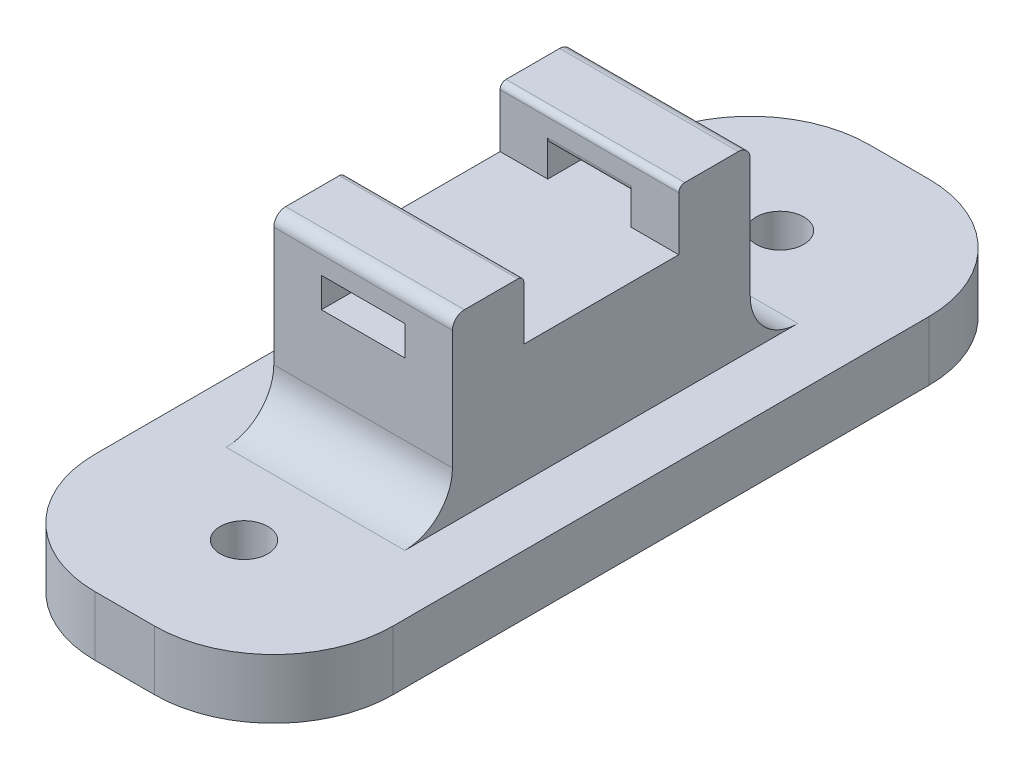
ISO-10303-21;
HEADER;
FILE_DESCRIPTION(('STEP AP214'),'2;1');
FILE_NAME('part.step','',(''),(''),'','','');
FILE_SCHEMA(('AUTOMOTIVE_DESIGN { 1 0 10303 214 1 1 1 1 }'));
ENDSEC;
DATA;
#1=APPLICATION_CONTEXT('core data for automotive mechanical design processes');
#2=APPLICATION_PROTOCOL_DEFINITION('international standard','automotive_design',2000,#1);
#3=PRODUCT_CONTEXT('',#1,'mechanical');
#4=PRODUCT('Part','Part','',(#3));
#5=PRODUCT_RELATED_PRODUCT_CATEGORY('part','',(#4));
#6=PRODUCT_DEFINITION_FORMATION('','',#4);
#7=PRODUCT_DEFINITION_CONTEXT('part definition',#1,'design');
#8=PRODUCT_DEFINITION('design','',#6,#7);
#9=PRODUCT_DEFINITION_SHAPE('','',#8);
#10=(LENGTH_UNIT() NAMED_UNIT(*) SI_UNIT(.MILLI.,.METRE.));
#11=(NAMED_UNIT(*) PLANE_ANGLE_UNIT() SI_UNIT($,.RADIAN.));
#12=(NAMED_UNIT(*) SI_UNIT($,.STERADIAN.) SOLID_ANGLE_UNIT());
#13=UNCERTAINTY_MEASURE_WITH_UNIT(LENGTH_MEASURE(1.E-05),#10,'distance_accuracy_value','');
#14=(GEOMETRIC_REPRESENTATION_CONTEXT(3) GLOBAL_UNCERTAINTY_ASSIGNED_CONTEXT((#13)) GLOBAL_UNIT_ASSIGNED_CONTEXT((#10,
#11,#12)) REPRESENTATION_CONTEXT('',''));
#15=CARTESIAN_POINT('',(0.,0.,0.));
#16=DIRECTION('',(0.,0.,1.));
#17=DIRECTION('',(1.,0.,0.));
#18=AXIS2_PLACEMENT_3D('',#15,#16,#17);
#19=CARTESIAN_POINT('',(0.,15.,0.));
#20=DIRECTION('',(0.,1.,0.));
#21=DIRECTION('',(0.,0.,1.));
#22=AXIS2_PLACEMENT_3D('',#19,#20,#21);
#23=PLANE('',#22);
#24=DIRECTION('',(-1.,0.,0.));
#25=VECTOR('',#24,1.);
#26=CARTESIAN_POINT('',(20.,15.,-26.));
#27=LINE('',#26,#25);
#28=CARTESIAN_POINT('',(9.,15.,-26.));
#29=VERTEX_POINT('',#28);
#30=CARTESIAN_POINT('',(5.,15.,-26.));
#31=VERTEX_POINT('',#30);
#32=EDGE_CURVE('E297',#29,#31,#27,.T.);
#33=ORIENTED_EDGE('',*,*,#32,.F.);
#34=DIRECTION('',(0.,0.,-1.));
#35=VECTOR('',#34,1.);
#36=CARTESIAN_POINT('',(9.,15.,0.));
#37=LINE('',#36,#35);
#38=CARTESIAN_POINT('',(9.,15.,-20.));
#39=VERTEX_POINT('',#38);
#40=EDGE_CURVE('E253',#39,#29,#37,.T.);
#41=ORIENTED_EDGE('',*,*,#40,.F.);
#42=DIRECTION('',(-1.,0.,0.));
#43=VECTOR('',#42,1.);
#44=CARTESIAN_POINT('',(20.,15.,-20.));
#45=LINE('',#44,#43);
#46=CARTESIAN_POINT('',(16.,15.,-20.));
#47=VERTEX_POINT('',#46);
#48=EDGE_CURVE('E281',#47,#39,#45,.T.);
#49=ORIENTED_EDGE('',*,*,#48,.F.);
#50=DIRECTION('',(0.,0.,-1.));
#51=VECTOR('',#50,1.);
#52=CARTESIAN_POINT('',(16.,15.,0.));
#53=LINE('',#52,#51);
#54=CARTESIAN_POINT('',(16.,15.,-26.));
#55=VERTEX_POINT('',#54);
#56=EDGE_CURVE('E254',#47,#55,#53,.T.);
#57=ORIENTED_EDGE('',*,*,#56,.T.);
#58=CARTESIAN_POINT('',(20.,15.,-26.));
#59=VERTEX_POINT('',#58);
#60=EDGE_CURVE('E301',#59,#55,#27,.T.);
#61=ORIENTED_EDGE('',*,*,#60,.F.);
#62=DIRECTION('',(0.,0.,-1.));
#63=VECTOR('',#62,1.);
#64=CARTESIAN_POINT('',(20.,15.,-20.));
#65=LINE('',#64,#63);
#66=CARTESIAN_POINT('',(20.,15.,-39.));
#67=VERTEX_POINT('',#66);
#68=EDGE_CURVE('E323',#59,#67,#65,.T.);
#69=ORIENTED_EDGE('',*,*,#68,.T.);
#70=DIRECTION('',(1.,0.,0.));
#71=VECTOR('',#70,1.);
#72=CARTESIAN_POINT('',(5.,15.,-39.));
#73=LINE('',#72,#71);
#74=CARTESIAN_POINT('',(16.,15.,-39.));
#75=VERTEX_POINT('',#74);
#76=EDGE_CURVE('E310',#75,#67,#73,.T.);
#77=ORIENTED_EDGE('',*,*,#76,.F.);
#78=CARTESIAN_POINT('',(16.,15.,-45.));
#79=VERTEX_POINT('',#78);
#80=EDGE_CURVE('E261',#75,#79,#53,.T.);
#81=ORIENTED_EDGE('',*,*,#80,.T.);
#82=DIRECTION('',(-1.,0.,0.));
#83=VECTOR('',#82,1.);
#84=CARTESIAN_POINT('',(16.,15.,-45.));
#85=LINE('',#84,#83);
#86=CARTESIAN_POINT('',(9.,15.,-45.));
#87=VERTEX_POINT('',#86);
#88=EDGE_CURVE('E258',#79,#87,#85,.T.);
#89=ORIENTED_EDGE('',*,*,#88,.T.);
#90=CARTESIAN_POINT('',(9.,15.,-39.));
#91=VERTEX_POINT('',#90);
#92=EDGE_CURVE('E241',#91,#87,#37,.T.);
#93=ORIENTED_EDGE('',*,*,#92,.F.);
#94=CARTESIAN_POINT('',(5.,15.,-39.));
#95=VERTEX_POINT('',#94);
#96=EDGE_CURVE('E314',#95,#91,#73,.T.);
#97=ORIENTED_EDGE('',*,*,#96,.F.);
#98=DIRECTION('',(0.,0.,1.));
#99=VECTOR('',#98,1.);
#100=CARTESIAN_POINT('',(5.,15.,-20.));
#101=LINE('',#100,#99);
#102=EDGE_CURVE('E326',#95,#31,#101,.T.);
#103=ORIENTED_EDGE('',*,*,#102,.T.);
#104=EDGE_LOOP('',(#33,#41,#49,#57,#61,#69,#77,#81,#89,#93,#97,#103));
#105=FACE_BOUND('',#104,.T.);
#106=ADVANCED_FACE('F32',(#105),#23,.T.);
#107=CARTESIAN_POINT('',(0.,5.,0.));
#108=DIRECTION('',(0.,-1.,0.));
#109=DIRECTION('',(0.,0.,-1.));
#110=AXIS2_PLACEMENT_3D('',#107,#108,#109);
#111=PLANE('',#110);
#112=DIRECTION('',(1.,0.,0.));
#113=VECTOR('',#112,1.);
#114=CARTESIAN_POINT('',(0.,5.,0.));
#115=LINE('',#114,#113);
#116=CARTESIAN_POINT('',(10.,5.,0.));
#117=VERTEX_POINT('',#116);
#118=CARTESIAN_POINT('',(15.,5.,0.));
#119=VERTEX_POINT('',#118);
#120=EDGE_CURVE('E359',#117,#119,#115,.T.);
#121=ORIENTED_EDGE('',*,*,#120,.T.);
#122=CARTESIAN_POINT('',(15.,5.,-10.));
#123=DIRECTION('',(0.,-1.,0.));
#124=DIRECTION('',(0.,0.,-1.));
#125=AXIS2_PLACEMENT_3D('',#122,#123,#124);
#126=CIRCLE('',#125,10.);
#127=CARTESIAN_POINT('',(25.,5.,-10.));
#128=VERTEX_POINT('',#127);
#129=EDGE_CURVE('E465',#119,#128,#126,.F.);
#130=ORIENTED_EDGE('',*,*,#129,.T.);
#131=DIRECTION('',(0.,0.,-1.));
#132=VECTOR('',#131,1.);
#133=CARTESIAN_POINT('',(25.,5.,0.));
#134=LINE('',#133,#132);
#135=CARTESIAN_POINT('',(25.,5.,-55.));
#136=VERTEX_POINT('',#135);
#137=EDGE_CURVE('E363',#128,#136,#134,.T.);
#138=ORIENTED_EDGE('',*,*,#137,.T.);
#139=CARTESIAN_POINT('',(15.,5.,-55.));
#140=DIRECTION('',(0.,-1.,0.));
#141=DIRECTION('',(0.,0.,-1.));
#142=AXIS2_PLACEMENT_3D('',#139,#140,#141);
#143=CIRCLE('',#142,10.);
#144=CARTESIAN_POINT('',(15.,5.,-65.));
#145=VERTEX_POINT('',#144);
#146=EDGE_CURVE('E459',#136,#145,#143,.F.);
#147=ORIENTED_EDGE('',*,*,#146,.T.);
#148=DIRECTION('',(-1.,0.,0.));
#149=VECTOR('',#148,1.);
#150=CARTESIAN_POINT('',(0.,5.,-65.));
#151=LINE('',#150,#149);
#152=CARTESIAN_POINT('',(10.,5.,-65.));
#153=VERTEX_POINT('',#152);
#154=EDGE_CURVE('E366',#145,#153,#151,.T.);
#155=ORIENTED_EDGE('',*,*,#154,.T.);
#156=CARTESIAN_POINT('',(10.,5.,-55.));
#157=DIRECTION('',(0.,-1.,0.));
#158=DIRECTION('',(0.,0.,-1.));
#159=AXIS2_PLACEMENT_3D('',#156,#157,#158);
#160=CIRCLE('',#159,10.);
#161=CARTESIAN_POINT('',(0.,5.,-55.));
#162=VERTEX_POINT('',#161);
#163=EDGE_CURVE('E461',#153,#162,#160,.F.);
#164=ORIENTED_EDGE('',*,*,#163,.T.);
#165=DIRECTION('',(0.,0.,1.));
#166=VECTOR('',#165,1.);
#167=CARTESIAN_POINT('',(0.,5.,0.));
#168=LINE('',#167,#166);
#169=CARTESIAN_POINT('',(0.,5.,-10.));
#170=VERTEX_POINT('',#169);
#171=EDGE_CURVE('E356',#162,#170,#168,.T.);
#172=ORIENTED_EDGE('',*,*,#171,.T.);
#173=CARTESIAN_POINT('',(10.,5.,-10.));
#174=DIRECTION('',(0.,-1.,0.));
#175=DIRECTION('',(0.,0.,-1.));
#176=AXIS2_PLACEMENT_3D('',#173,#174,#175);
#177=CIRCLE('',#176,10.);
#178=EDGE_CURVE('E463',#170,#117,#177,.F.);
#179=ORIENTED_EDGE('',*,*,#178,.T.);
#180=EDGE_LOOP('',(#121,#130,#138,#147,#155,#164,#172,#179));
#181=FACE_BOUND('',#180,.T.);
#182=CARTESIAN_POINT('',(12.5,5.,-10.));
#183=DIRECTION('',(0.,1.,0.));
#184=DIRECTION('',(0.,0.,1.));
#185=AXIS2_PLACEMENT_3D('',#182,#183,#184);
#186=CIRCLE('',#185,2.);
#187=CARTESIAN_POINT('',(12.5,5.,-8.));
#188=VERTEX_POINT('',#187);
#189=EDGE_CURVE('E351',#188,#188,#186,.T.);
#190=ORIENTED_EDGE('',*,*,#189,.F.);
#191=EDGE_LOOP('',(#190));
#192=FACE_BOUND('',#191,.T.);
#193=CARTESIAN_POINT('',(12.5,5.,-55.));
#194=DIRECTION('',(0.,1.,0.));
#195=DIRECTION('',(0.,0.,1.));
#196=AXIS2_PLACEMENT_3D('',#193,#194,#195);
#197=CIRCLE('',#196,2.);
#198=CARTESIAN_POINT('',(12.5,5.,-53.));
#199=VERTEX_POINT('',#198);
#200=EDGE_CURVE('E344',#199,#199,#197,.T.);
#201=ORIENTED_EDGE('',*,*,#200,.F.);
#202=EDGE_LOOP('',(#201));
#203=FACE_BOUND('',#202,.T.);
#204=DIRECTION('',(0.,0.,1.));
#205=VECTOR('',#204,1.);
#206=CARTESIAN_POINT('',(5.,5.,-20.));
#207=LINE('',#206,#205);
#208=CARTESIAN_POINT('',(5.,5.,-49.));
#209=VERTEX_POINT('',#208);
#210=CARTESIAN_POINT('',(5.,5.,-16.));
#211=VERTEX_POINT('',#210);
#212=EDGE_CURVE('E327',#209,#211,#207,.T.);
#213=ORIENTED_EDGE('',*,*,#212,.F.);
#214=DIRECTION('',(-1.,0.,0.));
#215=VECTOR('',#214,1.);
#216=CARTESIAN_POINT('',(20.,5.,-49.));
#217=LINE('',#216,#215);
#218=CARTESIAN_POINT('',(20.,5.,-49.));
#219=VERTEX_POINT('',#218);
#220=EDGE_CURVE('E483',#209,#219,#217,.F.);
#221=ORIENTED_EDGE('',*,*,#220,.T.);
#222=DIRECTION('',(0.,0.,-1.));
#223=VECTOR('',#222,1.);
#224=CARTESIAN_POINT('',(20.,5.,-20.));
#225=LINE('',#224,#223);
#226=CARTESIAN_POINT('',(20.,5.,-16.));
#227=VERTEX_POINT('',#226);
#228=EDGE_CURVE('E322',#227,#219,#225,.T.);
#229=ORIENTED_EDGE('',*,*,#228,.F.);
#230=DIRECTION('',(1.,0.,0.));
#231=VECTOR('',#230,1.);
#232=CARTESIAN_POINT('',(5.,5.,-16.));
#233=LINE('',#232,#231);
#234=EDGE_CURVE('E480',#227,#211,#233,.F.);
#235=ORIENTED_EDGE('',*,*,#234,.T.);
#236=EDGE_LOOP('',(#213,#221,#229,#235));
#237=FACE_BOUND('',#236,.T.);
#238=ADVANCED_FACE('F497',(#181,#192,#203,#237),#111,.F.);
#239=CARTESIAN_POINT('',(0.,5.,0.));
#240=DIRECTION('',(1.,0.,0.));
#241=DIRECTION('',(0.,0.,-1.));
#242=AXIS2_PLACEMENT_3D('',#239,#240,#241);
#243=PLANE('',#242);
#244=DIRECTION('',(0.,0.,1.));
#245=VECTOR('',#244,1.);
#246=CARTESIAN_POINT('',(0.,0.,0.));
#247=LINE('',#246,#245);
#248=CARTESIAN_POINT('',(0.,0.,-55.));
#249=VERTEX_POINT('',#248);
#250=CARTESIAN_POINT('',(0.,0.,-10.));
#251=VERTEX_POINT('',#250);
#252=EDGE_CURVE('E347',#249,#251,#247,.T.);
#253=ORIENTED_EDGE('',*,*,#252,.T.);
#254=DIRECTION('',(0.,-1.,0.));
#255=VECTOR('',#254,1.);
#256=CARTESIAN_POINT('',(0.,5.,-10.));
#257=LINE('',#256,#255);
#258=EDGE_CURVE('E470',#251,#170,#257,.F.);
#259=ORIENTED_EDGE('',*,*,#258,.T.);
#260=ORIENTED_EDGE('',*,*,#171,.F.);
#261=DIRECTION('',(0.,-1.,0.));
#262=VECTOR('',#261,1.);
#263=CARTESIAN_POINT('',(0.,5.,-55.));
#264=LINE('',#263,#262);
#265=EDGE_CURVE('E467',#162,#249,#264,.T.);
#266=ORIENTED_EDGE('',*,*,#265,.T.);
#267=EDGE_LOOP('',(#253,#259,#260,#266));
#268=FACE_BOUND('',#267,.T.);
#269=ADVANCED_FACE('F559',(#268),#243,.F.);
#270=CARTESIAN_POINT('',(0.,5.,0.));
#271=DIRECTION('',(0.,0.,-1.));
#272=DIRECTION('',(-1.,0.,0.));
#273=AXIS2_PLACEMENT_3D('',#270,#271,#272);
#274=PLANE('',#273);
#275=DIRECTION('',(1.,0.,0.));
#276=VECTOR('',#275,1.);
#277=CARTESIAN_POINT('',(0.,0.,0.));
#278=LINE('',#277,#276);
#279=CARTESIAN_POINT('',(10.,0.,0.));
#280=VERTEX_POINT('',#279);
#281=CARTESIAN_POINT('',(15.,0.,0.));
#282=VERTEX_POINT('',#281);
#283=EDGE_CURVE('E372',#280,#282,#278,.T.);
#284=ORIENTED_EDGE('',*,*,#283,.T.);
#285=DIRECTION('',(0.,-1.,0.));
#286=VECTOR('',#285,1.);
#287=CARTESIAN_POINT('',(15.,5.,0.));
#288=LINE('',#287,#286);
#289=EDGE_CURVE('E457',#282,#119,#288,.F.);
#290=ORIENTED_EDGE('',*,*,#289,.T.);
#291=ORIENTED_EDGE('',*,*,#120,.F.);
#292=DIRECTION('',(0.,-1.,0.));
#293=VECTOR('',#292,1.);
#294=CARTESIAN_POINT('',(10.,5.,0.));
#295=LINE('',#294,#293);
#296=EDGE_CURVE('E454',#117,#280,#295,.T.);
#297=ORIENTED_EDGE('',*,*,#296,.T.);
#298=EDGE_LOOP('',(#284,#290,#291,#297));
#299=FACE_BOUND('',#298,.T.);
#300=ADVANCED_FACE('F751',(#299),#274,.F.);
#301=CARTESIAN_POINT('',(25.,5.,0.));
#302=DIRECTION('',(-1.,0.,0.));
#303=DIRECTION('',(0.,0.,1.));
#304=AXIS2_PLACEMENT_3D('',#301,#302,#303);
#305=PLANE('',#304);
#306=ORIENTED_EDGE('',*,*,#137,.F.);
#307=DIRECTION('',(0.,-1.,0.));
#308=VECTOR('',#307,1.);
#309=CARTESIAN_POINT('',(25.,5.,-10.));
#310=LINE('',#309,#308);
#311=CARTESIAN_POINT('',(25.,0.,-10.));
#312=VERTEX_POINT('',#311);
#313=EDGE_CURVE('E443',#128,#312,#310,.T.);
#314=ORIENTED_EDGE('',*,*,#313,.T.);
#315=DIRECTION('',(0.,0.,-1.));
#316=VECTOR('',#315,1.);
#317=CARTESIAN_POINT('',(25.,0.,0.));
#318=LINE('',#317,#316);
#319=CARTESIAN_POINT('',(25.,0.,-55.));
#320=VERTEX_POINT('',#319);
#321=EDGE_CURVE('E375',#312,#320,#318,.T.);
#322=ORIENTED_EDGE('',*,*,#321,.T.);
#323=DIRECTION('',(0.,-1.,0.));
#324=VECTOR('',#323,1.);
#325=CARTESIAN_POINT('',(25.,5.,-55.));
#326=LINE('',#325,#324);
#327=EDGE_CURVE('E441',#320,#136,#326,.F.);
#328=ORIENTED_EDGE('',*,*,#327,.T.);
#329=EDGE_LOOP('',(#306,#314,#322,#328));
#330=FACE_BOUND('',#329,.T.);
#331=ADVANCED_FACE('F741',(#330),#305,.F.);
#332=CARTESIAN_POINT('',(0.,5.,-65.));
#333=DIRECTION('',(0.,0.,1.));
#334=DIRECTION('',(1.,0.,0.));
#335=AXIS2_PLACEMENT_3D('',#332,#333,#334);
#336=PLANE('',#335);
#337=DIRECTION('',(-1.,0.,0.));
#338=VECTOR('',#337,1.);
#339=CARTESIAN_POINT('',(0.,0.,-65.));
#340=LINE('',#339,#338);
#341=CARTESIAN_POINT('',(15.,0.,-65.));
#342=VERTEX_POINT('',#341);
#343=CARTESIAN_POINT('',(10.,0.,-65.));
#344=VERTEX_POINT('',#343);
#345=EDGE_CURVE('E360',#342,#344,#340,.T.);
#346=ORIENTED_EDGE('',*,*,#345,.T.);
#347=DIRECTION('',(0.,-1.,0.));
#348=VECTOR('',#347,1.);
#349=CARTESIAN_POINT('',(10.,5.,-65.));
#350=LINE('',#349,#348);
#351=EDGE_CURVE('E475',#344,#153,#350,.F.);
#352=ORIENTED_EDGE('',*,*,#351,.T.);
#353=ORIENTED_EDGE('',*,*,#154,.F.);
#354=DIRECTION('',(0.,-1.,0.));
#355=VECTOR('',#354,1.);
#356=CARTESIAN_POINT('',(15.,5.,-65.));
#357=LINE('',#356,#355);
#358=EDGE_CURVE('E472',#145,#342,#357,.T.);
#359=ORIENTED_EDGE('',*,*,#358,.T.);
#360=EDGE_LOOP('',(#346,#352,#353,#359));
#361=FACE_BOUND('',#360,.T.);
#362=ADVANCED_FACE('F729',(#361),#336,.F.);
#363=CARTESIAN_POINT('',(0.,0.,0.));
#364=DIRECTION('',(0.,-1.,0.));
#365=DIRECTION('',(0.,0.,-1.));
#366=AXIS2_PLACEMENT_3D('',#363,#364,#365);
#367=PLANE('',#366);
#368=CARTESIAN_POINT('',(12.5,0.,-55.));
#369=DIRECTION('',(0.,1.,0.));
#370=DIRECTION('',(0.,0.,1.));
#371=AXIS2_PLACEMENT_3D('',#368,#369,#370);
#372=CIRCLE('',#371,2.);
#373=CARTESIAN_POINT('',(12.5,0.,-53.));
#374=VERTEX_POINT('',#373);
#375=EDGE_CURVE('E348',#374,#374,#372,.T.);
#376=ORIENTED_EDGE('',*,*,#375,.T.);
#377=EDGE_LOOP('',(#376));
#378=FACE_BOUND('',#377,.T.);
#379=CARTESIAN_POINT('',(12.5,0.,-10.));
#380=DIRECTION('',(0.,1.,0.));
#381=DIRECTION('',(0.,0.,1.));
#382=AXIS2_PLACEMENT_3D('',#379,#380,#381);
#383=CIRCLE('',#382,2.);
#384=CARTESIAN_POINT('',(12.5,0.,-8.));
#385=VERTEX_POINT('',#384);
#386=EDGE_CURVE('E343',#385,#385,#383,.T.);
#387=ORIENTED_EDGE('',*,*,#386,.T.);
#388=EDGE_LOOP('',(#387));
#389=FACE_BOUND('',#388,.T.);
#390=ORIENTED_EDGE('',*,*,#321,.F.);
#391=CARTESIAN_POINT('',(15.,0.,-10.));
#392=DIRECTION('',(0.,-1.,0.));
#393=DIRECTION('',(0.,0.,-1.));
#394=AXIS2_PLACEMENT_3D('',#391,#392,#393);
#395=CIRCLE('',#394,10.);
#396=EDGE_CURVE('E452',#312,#282,#395,.T.);
#397=ORIENTED_EDGE('',*,*,#396,.T.);
#398=ORIENTED_EDGE('',*,*,#283,.F.);
#399=CARTESIAN_POINT('',(10.,0.,-10.));
#400=DIRECTION('',(0.,-1.,0.));
#401=DIRECTION('',(0.,0.,-1.));
#402=AXIS2_PLACEMENT_3D('',#399,#400,#401);
#403=CIRCLE('',#402,10.);
#404=EDGE_CURVE('E450',#280,#251,#403,.T.);
#405=ORIENTED_EDGE('',*,*,#404,.T.);
#406=ORIENTED_EDGE('',*,*,#252,.F.);
#407=CARTESIAN_POINT('',(10.,0.,-55.));
#408=DIRECTION('',(0.,-1.,0.));
#409=DIRECTION('',(0.,0.,-1.));
#410=AXIS2_PLACEMENT_3D('',#407,#408,#409);
#411=CIRCLE('',#410,10.);
#412=EDGE_CURVE('E448',#249,#344,#411,.T.);
#413=ORIENTED_EDGE('',*,*,#412,.T.);
#414=ORIENTED_EDGE('',*,*,#345,.F.);
#415=CARTESIAN_POINT('',(15.,0.,-55.));
#416=DIRECTION('',(0.,-1.,0.));
#417=DIRECTION('',(0.,0.,-1.));
#418=AXIS2_PLACEMENT_3D('',#415,#416,#417);
#419=CIRCLE('',#418,10.);
#420=EDGE_CURVE('E446',#342,#320,#419,.T.);
#421=ORIENTED_EDGE('',*,*,#420,.T.);
#422=EDGE_LOOP('',(#390,#397,#398,#405,#406,#413,#414,#421));
#423=FACE_BOUND('',#422,.T.);
#424=ADVANCED_FACE('F723',(#378,#389,#423),#367,.T.);
#425=CARTESIAN_POINT('',(12.5,5.,-10.));
#426=DIRECTION('',(0.,-1.,0.));
#427=DIRECTION('',(0.,0.,-1.));
#428=AXIS2_PLACEMENT_3D('',#425,#426,#427);
#429=CYLINDRICAL_SURFACE('',#428,2.);
#430=ORIENTED_EDGE('',*,*,#189,.T.);
#431=EDGE_LOOP('',(#430));
#432=FACE_BOUND('',#431,.T.);
#433=ORIENTED_EDGE('',*,*,#386,.F.);
#434=EDGE_LOOP('',(#433));
#435=FACE_BOUND('',#434,.T.);
#436=ADVANCED_FACE('F728',(#432,#435),#429,.F.);
#437=CARTESIAN_POINT('',(12.5,5.,-55.));
#438=DIRECTION('',(0.,-1.,0.));
#439=DIRECTION('',(0.,0.,-1.));
#440=AXIS2_PLACEMENT_3D('',#437,#438,#439);
#441=CYLINDRICAL_SURFACE('',#440,2.);
#442=ORIENTED_EDGE('',*,*,#200,.T.);
#443=EDGE_LOOP('',(#442));
#444=FACE_BOUND('',#443,.T.);
#445=ORIENTED_EDGE('',*,*,#375,.F.);
#446=EDGE_LOOP('',(#445));
#447=FACE_BOUND('',#446,.T.);
#448=ADVANCED_FACE('F683',(#444,#447),#441,.F.);
#449=CARTESIAN_POINT('',(20.,15.,-20.));
#450=DIRECTION('',(-1.,0.,0.));
#451=DIRECTION('',(0.,0.,1.));
#452=AXIS2_PLACEMENT_3D('',#449,#450,#451);
#453=PLANE('',#452);
#454=DIRECTION('',(0.,0.,-1.));
#455=VECTOR('',#454,1.);
#456=CARTESIAN_POINT('',(20.,20.,-20.));
#457=LINE('',#456,#455);
#458=CARTESIAN_POINT('',(20.,20.,-21.));
#459=VERTEX_POINT('',#458);
#460=CARTESIAN_POINT('',(20.,20.,-25.5));
#461=VERTEX_POINT('',#460);
#462=EDGE_CURVE('E298',#459,#461,#457,.T.);
#463=ORIENTED_EDGE('',*,*,#462,.F.);
#464=CARTESIAN_POINT('',(20.,19.,-21.));
#465=DIRECTION('',(-1.,0.,0.));
#466=DIRECTION('',(0.,0.,1.));
#467=AXIS2_PLACEMENT_3D('',#464,#465,#466);
#468=CIRCLE('',#467,1.);
#469=CARTESIAN_POINT('',(20.,19.,-20.));
#470=VERTEX_POINT('',#469);
#471=EDGE_CURVE('E428',#459,#470,#468,.F.);
#472=ORIENTED_EDGE('',*,*,#471,.T.);
#473=DIRECTION('',(0.,-1.,0.));
#474=VECTOR('',#473,1.);
#475=CARTESIAN_POINT('',(20.,15.,-20.));
#476=LINE('',#475,#474);
#477=CARTESIAN_POINT('',(20.,9.,-20.));
#478=VERTEX_POINT('',#477);
#479=EDGE_CURVE('E330',#470,#478,#476,.T.);
#480=ORIENTED_EDGE('',*,*,#479,.T.);
#481=CARTESIAN_POINT('',(20.,9.,-16.));
#482=DIRECTION('',(-1.,0.,0.));
#483=DIRECTION('',(0.,0.,1.));
#484=AXIS2_PLACEMENT_3D('',#481,#482,#483);
#485=CIRCLE('',#484,4.);
#486=EDGE_CURVE('E40',#478,#227,#485,.T.);
#487=ORIENTED_EDGE('',*,*,#486,.T.);
#488=ORIENTED_EDGE('',*,*,#228,.T.);
#489=CARTESIAN_POINT('',(20.,9.,-49.));
#490=DIRECTION('',(-1.,0.,0.));
#491=DIRECTION('',(0.,0.,1.));
#492=AXIS2_PLACEMENT_3D('',#489,#490,#491);
#493=CIRCLE('',#492,4.);
#494=CARTESIAN_POINT('',(20.,9.,-45.));
#495=VERTEX_POINT('',#494);
#496=EDGE_CURVE('E491',#219,#495,#493,.T.);
#497=ORIENTED_EDGE('',*,*,#496,.T.);
#498=DIRECTION('',(0.,-1.,0.));
#499=VECTOR('',#498,1.);
#500=CARTESIAN_POINT('',(20.,15.,-45.));
#501=LINE('',#500,#499);
#502=CARTESIAN_POINT('',(20.,19.,-45.));
#503=VERTEX_POINT('',#502);
#504=EDGE_CURVE('E340',#503,#495,#501,.T.);
#505=ORIENTED_EDGE('',*,*,#504,.F.);
#506=CARTESIAN_POINT('',(20.,19.,-44.));
#507=DIRECTION('',(-1.,0.,0.));
#508=DIRECTION('',(0.,0.,1.));
#509=AXIS2_PLACEMENT_3D('',#506,#507,#508);
#510=CIRCLE('',#509,1.);
#511=CARTESIAN_POINT('',(20.,20.,-44.));
#512=VERTEX_POINT('',#511);
#513=EDGE_CURVE('E426',#503,#512,#510,.F.);
#514=ORIENTED_EDGE('',*,*,#513,.T.);
#515=DIRECTION('',(0.,0.,-1.));
#516=VECTOR('',#515,1.);
#517=CARTESIAN_POINT('',(20.,20.,-45.));
#518=LINE('',#517,#516);
#519=CARTESIAN_POINT('',(20.,20.,-39.5));
#520=VERTEX_POINT('',#519);
#521=EDGE_CURVE('E313',#520,#512,#518,.T.);
#522=ORIENTED_EDGE('',*,*,#521,.F.);
#523=CARTESIAN_POINT('',(20.,19.5,-39.5));
#524=DIRECTION('',(-1.,0.,0.));
#525=DIRECTION('',(0.,0.,1.));
#526=AXIS2_PLACEMENT_3D('',#523,#524,#525);
#527=CIRCLE('',#526,0.5);
#528=CARTESIAN_POINT('',(20.,19.5,-39.));
#529=VERTEX_POINT('',#528);
#530=EDGE_CURVE('E387',#520,#529,#527,.F.);
#531=ORIENTED_EDGE('',*,*,#530,.T.);
#532=DIRECTION('',(0.,-1.,0.));
#533=VECTOR('',#532,1.);
#534=CARTESIAN_POINT('',(20.,20.,-39.));
#535=LINE('',#534,#533);
#536=EDGE_CURVE('E317',#529,#67,#535,.T.);
#537=ORIENTED_EDGE('',*,*,#536,.T.);
#538=ORIENTED_EDGE('',*,*,#68,.F.);
#539=DIRECTION('',(0.,-1.,0.));
#540=VECTOR('',#539,1.);
#541=CARTESIAN_POINT('',(20.,20.,-26.));
#542=LINE('',#541,#540);
#543=CARTESIAN_POINT('',(20.,19.5,-26.));
#544=VERTEX_POINT('',#543);
#545=EDGE_CURVE('E308',#544,#59,#542,.T.);
#546=ORIENTED_EDGE('',*,*,#545,.F.);
#547=CARTESIAN_POINT('',(20.,19.5,-25.5));
#548=DIRECTION('',(-1.,0.,0.));
#549=DIRECTION('',(0.,0.,1.));
#550=AXIS2_PLACEMENT_3D('',#547,#548,#549);
#551=CIRCLE('',#550,0.5);
#552=EDGE_CURVE('E413',#544,#461,#551,.F.);
#553=ORIENTED_EDGE('',*,*,#552,.T.);
#554=EDGE_LOOP('',(#463,#472,#480,#487,#488,#497,#505,#514,#522,#531,#537,#538,#546,#553));
#555=FACE_BOUND('',#554,.T.);
#556=ADVANCED_FACE('F494',(#555),#453,.F.);
#557=CARTESIAN_POINT('',(20.,15.,-45.));
#558=DIRECTION('',(0.,0.,1.));
#559=DIRECTION('',(1.,0.,0.));
#560=AXIS2_PLACEMENT_3D('',#557,#558,#559);
#561=PLANE('',#560);
#562=ORIENTED_EDGE('',*,*,#88,.F.);
#563=DIRECTION('',(0.,-1.,0.));
#564=VECTOR('',#563,1.);
#565=CARTESIAN_POINT('',(16.,17.5,-45.));
#566=LINE('',#565,#564);
#567=CARTESIAN_POINT('',(16.,17.5,-45.));
#568=VERTEX_POINT('',#567);
#569=EDGE_CURVE('E264',#568,#79,#566,.T.);
#570=ORIENTED_EDGE('',*,*,#569,.F.);
#571=DIRECTION('',(1.,0.,0.));
#572=VECTOR('',#571,1.);
#573=CARTESIAN_POINT('',(16.,17.5,-45.));
#574=LINE('',#573,#572);
#575=CARTESIAN_POINT('',(9.,17.5,-45.));
#576=VERTEX_POINT('',#575);
#577=EDGE_CURVE('E269',#576,#568,#574,.T.);
#578=ORIENTED_EDGE('',*,*,#577,.F.);
#579=DIRECTION('',(0.,1.,0.));
#580=VECTOR('',#579,1.);
#581=CARTESIAN_POINT('',(9.,17.5,-45.));
#582=LINE('',#581,#580);
#583=EDGE_CURVE('E246',#87,#576,#582,.T.);
#584=ORIENTED_EDGE('',*,*,#583,.F.);
#585=EDGE_LOOP('',(#562,#570,#578,#584));
#586=FACE_BOUND('',#585,.T.);
#587=ORIENTED_EDGE('',*,*,#504,.T.);
#588=DIRECTION('',(-1.,0.,0.));
#589=VECTOR('',#588,1.);
#590=CARTESIAN_POINT('',(5.,9.,-45.));
#591=LINE('',#590,#589);
#592=CARTESIAN_POINT('',(5.,9.,-45.));
#593=VERTEX_POINT('',#592);
#594=EDGE_CURVE('E477',#495,#593,#591,.T.);
#595=ORIENTED_EDGE('',*,*,#594,.T.);
#596=DIRECTION('',(0.,-1.,0.));
#597=VECTOR('',#596,1.);
#598=CARTESIAN_POINT('',(5.,15.,-45.));
#599=LINE('',#598,#597);
#600=CARTESIAN_POINT('',(5.,19.,-45.));
#601=VERTEX_POINT('',#600);
#602=EDGE_CURVE('E337',#601,#593,#599,.T.);
#603=ORIENTED_EDGE('',*,*,#602,.F.);
#604=DIRECTION('',(-1.,0.,0.));
#605=VECTOR('',#604,1.);
#606=CARTESIAN_POINT('',(20.,19.,-45.));
#607=LINE('',#606,#605);
#608=EDGE_CURVE('E439',#601,#503,#607,.F.);
#609=ORIENTED_EDGE('',*,*,#608,.T.);
#610=EDGE_LOOP('',(#587,#595,#603,#609));
#611=FACE_BOUND('',#610,.T.);
#612=ADVANCED_FACE('F266',(#586,#611),#561,.F.);
#613=CARTESIAN_POINT('',(5.,15.,-20.));
#614=DIRECTION('',(1.,0.,0.));
#615=DIRECTION('',(0.,0.,-1.));
#616=AXIS2_PLACEMENT_3D('',#613,#614,#615);
#617=PLANE('',#616);
#618=DIRECTION('',(0.,-1.,0.));
#619=VECTOR('',#618,1.);
#620=CARTESIAN_POINT('',(5.,15.,-20.));
#621=LINE('',#620,#619);
#622=CARTESIAN_POINT('',(5.,19.,-20.));
#623=VERTEX_POINT('',#622);
#624=CARTESIAN_POINT('',(5.,9.,-20.));
#625=VERTEX_POINT('',#624);
#626=EDGE_CURVE('E335',#623,#625,#621,.T.);
#627=ORIENTED_EDGE('',*,*,#626,.F.);
#628=CARTESIAN_POINT('',(5.,19.,-21.));
#629=DIRECTION('',(1.,0.,0.));
#630=DIRECTION('',(0.,0.,-1.));
#631=AXIS2_PLACEMENT_3D('',#628,#629,#630);
#632=CIRCLE('',#631,1.);
#633=CARTESIAN_POINT('',(5.,20.,-21.));
#634=VERTEX_POINT('',#633);
#635=EDGE_CURVE('E434',#623,#634,#632,.F.);
#636=ORIENTED_EDGE('',*,*,#635,.T.);
#637=DIRECTION('',(0.,0.,1.));
#638=VECTOR('',#637,1.);
#639=CARTESIAN_POINT('',(5.,20.,-20.));
#640=LINE('',#639,#638);
#641=CARTESIAN_POINT('',(5.,20.,-25.5));
#642=VERTEX_POINT('',#641);
#643=EDGE_CURVE('E300',#642,#634,#640,.T.);
#644=ORIENTED_EDGE('',*,*,#643,.F.);
#645=CARTESIAN_POINT('',(5.,19.5,-25.5));
#646=DIRECTION('',(1.,0.,0.));
#647=DIRECTION('',(0.,0.,-1.));
#648=AXIS2_PLACEMENT_3D('',#645,#646,#647);
#649=CIRCLE('',#648,0.5);
#650=CARTESIAN_POINT('',(5.,19.5,-26.));
#651=VERTEX_POINT('',#650);
#652=EDGE_CURVE('E406',#642,#651,#649,.F.);
#653=ORIENTED_EDGE('',*,*,#652,.T.);
#654=DIRECTION('',(0.,-1.,0.));
#655=VECTOR('',#654,1.);
#656=CARTESIAN_POINT('',(5.,20.,-26.));
#657=LINE('',#656,#655);
#658=EDGE_CURVE('E304',#651,#31,#657,.T.);
#659=ORIENTED_EDGE('',*,*,#658,.T.);
#660=ORIENTED_EDGE('',*,*,#102,.F.);
#661=DIRECTION('',(0.,-1.,0.));
#662=VECTOR('',#661,1.);
#663=CARTESIAN_POINT('',(5.,20.,-39.));
#664=LINE('',#663,#662);
#665=CARTESIAN_POINT('',(5.,19.5,-39.));
#666=VERTEX_POINT('',#665);
#667=EDGE_CURVE('E320',#666,#95,#664,.T.);
#668=ORIENTED_EDGE('',*,*,#667,.F.);
#669=CARTESIAN_POINT('',(5.,19.5,-39.5));
#670=DIRECTION('',(1.,0.,0.));
#671=DIRECTION('',(0.,0.,-1.));
#672=AXIS2_PLACEMENT_3D('',#669,#670,#671);
#673=CIRCLE('',#672,0.5);
#674=CARTESIAN_POINT('',(5.,20.,-39.5));
#675=VERTEX_POINT('',#674);
#676=EDGE_CURVE('E394',#666,#675,#673,.F.);
#677=ORIENTED_EDGE('',*,*,#676,.T.);
#678=DIRECTION('',(0.,0.,1.));
#679=VECTOR('',#678,1.);
#680=CARTESIAN_POINT('',(5.,20.,-45.));
#681=LINE('',#680,#679);
#682=CARTESIAN_POINT('',(5.,20.,-44.));
#683=VERTEX_POINT('',#682);
#684=EDGE_CURVE('E311',#683,#675,#681,.T.);
#685=ORIENTED_EDGE('',*,*,#684,.F.);
#686=CARTESIAN_POINT('',(5.,19.,-44.));
#687=DIRECTION('',(1.,0.,0.));
#688=DIRECTION('',(0.,0.,-1.));
#689=AXIS2_PLACEMENT_3D('',#686,#687,#688);
#690=CIRCLE('',#689,1.);
#691=EDGE_CURVE('E432',#683,#601,#690,.F.);
#692=ORIENTED_EDGE('',*,*,#691,.T.);
#693=ORIENTED_EDGE('',*,*,#602,.T.);
#694=CARTESIAN_POINT('',(5.,9.,-49.));
#695=DIRECTION('',(1.,0.,0.));
#696=DIRECTION('',(0.,0.,-1.));
#697=AXIS2_PLACEMENT_3D('',#694,#695,#696);
#698=CIRCLE('',#697,4.);
#699=EDGE_CURVE('E488',#593,#209,#698,.T.);
#700=ORIENTED_EDGE('',*,*,#699,.T.);
#701=ORIENTED_EDGE('',*,*,#212,.T.);
#702=CARTESIAN_POINT('',(5.,9.,-16.));
#703=DIRECTION('',(1.,0.,0.));
#704=DIRECTION('',(0.,0.,-1.));
#705=AXIS2_PLACEMENT_3D('',#702,#703,#704);
#706=CIRCLE('',#705,4.);
#707=EDGE_CURVE('E11',#211,#625,#706,.T.);
#708=ORIENTED_EDGE('',*,*,#707,.T.);
#709=EDGE_LOOP('',(#627,#636,#644,#653,#659,#660,#668,#677,#685,#692,#693,#700,#701,#708));
#710=FACE_BOUND('',#709,.T.);
#711=ADVANCED_FACE('F537',(#710),#617,.F.);
#712=CARTESIAN_POINT('',(20.,15.,-20.));
#713=DIRECTION('',(0.,0.,-1.));
#714=DIRECTION('',(-1.,0.,0.));
#715=AXIS2_PLACEMENT_3D('',#712,#713,#714);
#716=PLANE('',#715);
#717=DIRECTION('',(1.,0.,0.));
#718=VECTOR('',#717,1.);
#719=CARTESIAN_POINT('',(20.,17.5,-20.));
#720=LINE('',#719,#718);
#721=CARTESIAN_POINT('',(9.,17.5,-20.));
#722=VERTEX_POINT('',#721);
#723=CARTESIAN_POINT('',(16.,17.5,-20.));
#724=VERTEX_POINT('',#723);
#725=EDGE_CURVE('E288',#722,#724,#720,.T.);
#726=ORIENTED_EDGE('',*,*,#725,.T.);
#727=DIRECTION('',(0.,-1.,0.));
#728=VECTOR('',#727,1.);
#729=CARTESIAN_POINT('',(16.,15.,-20.));
#730=LINE('',#729,#728);
#731=EDGE_CURVE('E294',#724,#47,#730,.T.);
#732=ORIENTED_EDGE('',*,*,#731,.T.);
#733=ORIENTED_EDGE('',*,*,#48,.T.);
#734=DIRECTION('',(0.,1.,0.));
#735=VECTOR('',#734,1.);
#736=CARTESIAN_POINT('',(9.,15.,-20.));
#737=LINE('',#736,#735);
#738=EDGE_CURVE('E285',#39,#722,#737,.T.);
#739=ORIENTED_EDGE('',*,*,#738,.T.);
#740=EDGE_LOOP('',(#726,#732,#733,#739));
#741=FACE_BOUND('',#740,.T.);
#742=ORIENTED_EDGE('',*,*,#626,.T.);
#743=DIRECTION('',(1.,0.,0.));
#744=VECTOR('',#743,1.);
#745=CARTESIAN_POINT('',(20.,9.,-20.));
#746=LINE('',#745,#744);
#747=EDGE_CURVE('E486',#625,#478,#746,.T.);
#748=ORIENTED_EDGE('',*,*,#747,.T.);
#749=ORIENTED_EDGE('',*,*,#479,.F.);
#750=DIRECTION('',(1.,0.,0.));
#751=VECTOR('',#750,1.);
#752=CARTESIAN_POINT('',(5.,19.,-20.));
#753=LINE('',#752,#751);
#754=EDGE_CURVE('E430',#470,#623,#753,.F.);
#755=ORIENTED_EDGE('',*,*,#754,.T.);
#756=EDGE_LOOP('',(#742,#748,#749,#755));
#757=FACE_BOUND('',#756,.T.);
#758=ADVANCED_FACE('F544',(#741,#757),#716,.F.);
#759=CARTESIAN_POINT('',(5.,20.,-39.));
#760=DIRECTION('',(0.,0.,-1.));
#761=DIRECTION('',(-1.,0.,0.));
#762=AXIS2_PLACEMENT_3D('',#759,#760,#761);
#763=PLANE('',#762);
#764=ORIENTED_EDGE('',*,*,#536,.F.);
#765=DIRECTION('',(1.,0.,0.));
#766=VECTOR('',#765,1.);
#767=CARTESIAN_POINT('',(5.,19.5,-39.));
#768=LINE('',#767,#766);
#769=EDGE_CURVE('E392',#529,#666,#768,.F.);
#770=ORIENTED_EDGE('',*,*,#769,.T.);
#771=ORIENTED_EDGE('',*,*,#667,.T.);
#772=ORIENTED_EDGE('',*,*,#96,.T.);
#773=DIRECTION('',(0.,1.,0.));
#774=VECTOR('',#773,1.);
#775=CARTESIAN_POINT('',(8.99999999999999,20.,-39.));
#776=LINE('',#775,#774);
#777=CARTESIAN_POINT('',(9.,18.,-39.));
#778=VERTEX_POINT('',#777);
#779=EDGE_CURVE('E249',#91,#778,#776,.T.);
#780=ORIENTED_EDGE('',*,*,#779,.T.);
#781=DIRECTION('',(1.,0.,0.));
#782=VECTOR('',#781,1.);
#783=CARTESIAN_POINT('',(5.,18.,-39.));
#784=LINE('',#783,#782);
#785=CARTESIAN_POINT('',(16.,18.,-39.));
#786=VERTEX_POINT('',#785);
#787=EDGE_CURVE('E389',#778,#786,#784,.T.);
#788=ORIENTED_EDGE('',*,*,#787,.T.);
#789=DIRECTION('',(0.,-1.,0.));
#790=VECTOR('',#789,1.);
#791=CARTESIAN_POINT('',(16.,20.,-39.));
#792=LINE('',#791,#790);
#793=EDGE_CURVE('E291',#786,#75,#792,.T.);
#794=ORIENTED_EDGE('',*,*,#793,.T.);
#795=ORIENTED_EDGE('',*,*,#76,.T.);
#796=EDGE_LOOP('',(#764,#770,#771,#772,#780,#788,#794,#795));
#797=FACE_BOUND('',#796,.T.);
#798=ADVANCED_FACE('F523',(#797),#763,.F.);
#799=CARTESIAN_POINT('',(0.,20.,0.));
#800=DIRECTION('',(0.,1.,0.));
#801=DIRECTION('',(0.,0.,1.));
#802=AXIS2_PLACEMENT_3D('',#799,#800,#801);
#803=PLANE('',#802);
#804=ORIENTED_EDGE('',*,*,#521,.T.);
#805=DIRECTION('',(-1.,0.,0.));
#806=VECTOR('',#805,1.);
#807=CARTESIAN_POINT('',(5.,20.,-44.));
#808=LINE('',#807,#806);
#809=EDGE_CURVE('E436',#512,#683,#808,.T.);
#810=ORIENTED_EDGE('',*,*,#809,.T.);
#811=ORIENTED_EDGE('',*,*,#684,.T.);
#812=DIRECTION('',(1.,0.,0.));
#813=VECTOR('',#812,1.);
#814=CARTESIAN_POINT('',(20.,20.,-39.5));
#815=LINE('',#814,#813);
#816=EDGE_CURVE('E384',#675,#520,#815,.T.);
#817=ORIENTED_EDGE('',*,*,#816,.T.);
#818=EDGE_LOOP('',(#804,#810,#811,#817));
#819=FACE_BOUND('',#818,.T.);
#820=ADVANCED_FACE('F512',(#819),#803,.T.);
#821=CARTESIAN_POINT('',(20.,20.,-26.));
#822=DIRECTION('',(0.,0.,1.));
#823=DIRECTION('',(1.,0.,0.));
#824=AXIS2_PLACEMENT_3D('',#821,#822,#823);
#825=PLANE('',#824);
#826=ORIENTED_EDGE('',*,*,#658,.F.);
#827=DIRECTION('',(-1.,0.,0.));
#828=VECTOR('',#827,1.);
#829=CARTESIAN_POINT('',(20.,19.5,-26.));
#830=LINE('',#829,#828);
#831=EDGE_CURVE('E411',#651,#544,#830,.F.);
#832=ORIENTED_EDGE('',*,*,#831,.T.);
#833=ORIENTED_EDGE('',*,*,#545,.T.);
#834=ORIENTED_EDGE('',*,*,#60,.T.);
#835=DIRECTION('',(0.,1.,0.));
#836=VECTOR('',#835,1.);
#837=CARTESIAN_POINT('',(16.,20.,-26.));
#838=LINE('',#837,#836);
#839=CARTESIAN_POINT('',(16.,18.,-26.));
#840=VERTEX_POINT('',#839);
#841=EDGE_CURVE('E382',#55,#840,#838,.T.);
#842=ORIENTED_EDGE('',*,*,#841,.T.);
#843=DIRECTION('',(-1.,0.,0.));
#844=VECTOR('',#843,1.);
#845=CARTESIAN_POINT('',(20.,18.,-26.));
#846=LINE('',#845,#844);
#847=CARTESIAN_POINT('',(9.,18.,-26.));
#848=VERTEX_POINT('',#847);
#849=EDGE_CURVE('E408',#840,#848,#846,.T.);
#850=ORIENTED_EDGE('',*,*,#849,.T.);
#851=DIRECTION('',(0.,-1.,0.));
#852=VECTOR('',#851,1.);
#853=CARTESIAN_POINT('',(8.99999999999999,20.,-26.));
#854=LINE('',#853,#852);
#855=EDGE_CURVE('E369',#848,#29,#854,.T.);
#856=ORIENTED_EDGE('',*,*,#855,.T.);
#857=ORIENTED_EDGE('',*,*,#32,.T.);
#858=EDGE_LOOP('',(#826,#832,#833,#834,#842,#850,#856,#857));
#859=FACE_BOUND('',#858,.T.);
#860=ADVANCED_FACE('F565',(#859),#825,.F.);
#861=CARTESIAN_POINT('',(0.,20.,0.));
#862=DIRECTION('',(0.,1.,0.));
#863=DIRECTION('',(0.,0.,1.));
#864=AXIS2_PLACEMENT_3D('',#861,#862,#863);
#865=PLANE('',#864);
#866=ORIENTED_EDGE('',*,*,#643,.T.);
#867=DIRECTION('',(1.,0.,0.));
#868=VECTOR('',#867,1.);
#869=CARTESIAN_POINT('',(20.,20.,-21.));
#870=LINE('',#869,#868);
#871=EDGE_CURVE('E423',#634,#459,#870,.T.);
#872=ORIENTED_EDGE('',*,*,#871,.T.);
#873=ORIENTED_EDGE('',*,*,#462,.T.);
#874=DIRECTION('',(-1.,0.,0.));
#875=VECTOR('',#874,1.);
#876=CARTESIAN_POINT('',(5.,20.,-25.5));
#877=LINE('',#876,#875);
#878=EDGE_CURVE('E403',#461,#642,#877,.T.);
#879=ORIENTED_EDGE('',*,*,#878,.T.);
#880=EDGE_LOOP('',(#866,#872,#873,#879));
#881=FACE_BOUND('',#880,.T.);
#882=ADVANCED_FACE('F535',(#881),#865,.T.);
#883=CARTESIAN_POINT('',(9.,17.5,0.));
#884=DIRECTION('',(-1.,0.,0.));
#885=DIRECTION('',(0.,-1.,0.));
#886=AXIS2_PLACEMENT_3D('',#883,#884,#885);
#887=PLANE('',#886);
#888=ORIENTED_EDGE('',*,*,#40,.T.);
#889=ORIENTED_EDGE('',*,*,#855,.F.);
#890=CARTESIAN_POINT('',(9.,18.,-25.5));
#891=DIRECTION('',(-1.,0.,0.));
#892=DIRECTION('',(0.,-1.,0.));
#893=AXIS2_PLACEMENT_3D('',#890,#891,#892);
#894=CIRCLE('',#893,0.5);
#895=CARTESIAN_POINT('',(9.,17.5,-25.5));
#896=VERTEX_POINT('',#895);
#897=EDGE_CURVE('E418',#848,#896,#894,.T.);
#898=ORIENTED_EDGE('',*,*,#897,.T.);
#899=DIRECTION('',(0.,0.,-1.));
#900=VECTOR('',#899,1.);
#901=CARTESIAN_POINT('',(9.,17.5,0.));
#902=LINE('',#901,#900);
#903=EDGE_CURVE('E277',#722,#896,#902,.T.);
#904=ORIENTED_EDGE('',*,*,#903,.F.);
#905=ORIENTED_EDGE('',*,*,#738,.F.);
#906=EDGE_LOOP('',(#888,#889,#898,#904,#905));
#907=FACE_BOUND('',#906,.T.);
#908=ADVANCED_FACE('F570',(#907),#887,.F.);
#909=CARTESIAN_POINT('',(16.,17.5,0.));
#910=DIRECTION('',(0.,1.,0.));
#911=DIRECTION('',(0.,0.,1.));
#912=AXIS2_PLACEMENT_3D('',#909,#910,#911);
#913=PLANE('',#912);
#914=ORIENTED_EDGE('',*,*,#903,.T.);
#915=DIRECTION('',(-1.,0.,0.));
#916=VECTOR('',#915,1.);
#917=CARTESIAN_POINT('',(16.,17.5,-25.5));
#918=LINE('',#917,#916);
#919=CARTESIAN_POINT('',(16.,17.5,-25.5));
#920=VERTEX_POINT('',#919);
#921=EDGE_CURVE('E416',#896,#920,#918,.F.);
#922=ORIENTED_EDGE('',*,*,#921,.T.);
#923=DIRECTION('',(0.,0.,-1.));
#924=VECTOR('',#923,1.);
#925=CARTESIAN_POINT('',(16.,17.5,0.));
#926=LINE('',#925,#924);
#927=EDGE_CURVE('E276',#724,#920,#926,.T.);
#928=ORIENTED_EDGE('',*,*,#927,.F.);
#929=ORIENTED_EDGE('',*,*,#725,.F.);
#930=EDGE_LOOP('',(#914,#922,#928,#929));
#931=FACE_BOUND('',#930,.T.);
#932=ADVANCED_FACE('F575',(#931),#913,.F.);
#933=CARTESIAN_POINT('',(16.,17.5,0.));
#934=DIRECTION('',(1.,0.,0.));
#935=DIRECTION('',(0.,1.,0.));
#936=AXIS2_PLACEMENT_3D('',#933,#934,#935);
#937=PLANE('',#936);
#938=ORIENTED_EDGE('',*,*,#927,.T.);
#939=CARTESIAN_POINT('',(16.,18.,-25.5));
#940=DIRECTION('',(1.,0.,0.));
#941=DIRECTION('',(0.,1.,0.));
#942=AXIS2_PLACEMENT_3D('',#939,#940,#941);
#943=CIRCLE('',#942,0.5);
#944=EDGE_CURVE('E420',#920,#840,#943,.T.);
#945=ORIENTED_EDGE('',*,*,#944,.T.);
#946=ORIENTED_EDGE('',*,*,#841,.F.);
#947=ORIENTED_EDGE('',*,*,#56,.F.);
#948=ORIENTED_EDGE('',*,*,#731,.F.);
#949=EDGE_LOOP('',(#938,#945,#946,#947,#948));
#950=FACE_BOUND('',#949,.T.);
#951=ADVANCED_FACE('F571',(#950),#937,.F.);
#952=ORIENTED_EDGE('',*,*,#793,.F.);
#953=CARTESIAN_POINT('',(16.,18.,-39.5));
#954=DIRECTION('',(1.,0.,0.));
#955=DIRECTION('',(0.,1.,0.));
#956=AXIS2_PLACEMENT_3D('',#953,#954,#955);
#957=CIRCLE('',#956,0.5);
#958=CARTESIAN_POINT('',(16.,17.5,-39.5));
#959=VERTEX_POINT('',#958);
#960=EDGE_CURVE('E399',#786,#959,#957,.T.);
#961=ORIENTED_EDGE('',*,*,#960,.T.);
#962=EDGE_CURVE('E274',#959,#568,#926,.T.);
#963=ORIENTED_EDGE('',*,*,#962,.T.);
#964=ORIENTED_EDGE('',*,*,#569,.T.);
#965=ORIENTED_EDGE('',*,*,#80,.F.);
#966=EDGE_LOOP('',(#952,#961,#963,#964,#965));
#967=FACE_BOUND('',#966,.T.);
#968=ADVANCED_FACE('F574',(#967),#937,.F.);
#969=ORIENTED_EDGE('',*,*,#962,.F.);
#970=DIRECTION('',(1.,0.,0.));
#971=VECTOR('',#970,1.);
#972=CARTESIAN_POINT('',(16.,17.5,-39.5));
#973=LINE('',#972,#971);
#974=CARTESIAN_POINT('',(9.,17.5,-39.5));
#975=VERTEX_POINT('',#974);
#976=EDGE_CURVE('E397',#959,#975,#973,.F.);
#977=ORIENTED_EDGE('',*,*,#976,.T.);
#978=EDGE_CURVE('E278',#975,#576,#902,.T.);
#979=ORIENTED_EDGE('',*,*,#978,.T.);
#980=ORIENTED_EDGE('',*,*,#577,.T.);
#981=EDGE_LOOP('',(#969,#977,#979,#980));
#982=FACE_BOUND('',#981,.T.);
#983=ADVANCED_FACE('F582',(#982),#913,.F.);
#984=ORIENTED_EDGE('',*,*,#92,.T.);
#985=ORIENTED_EDGE('',*,*,#583,.T.);
#986=ORIENTED_EDGE('',*,*,#978,.F.);
#987=CARTESIAN_POINT('',(9.,18.,-39.5));
#988=DIRECTION('',(-1.,0.,0.));
#989=DIRECTION('',(0.,-1.,0.));
#990=AXIS2_PLACEMENT_3D('',#987,#988,#989);
#991=CIRCLE('',#990,0.5);
#992=EDGE_CURVE('E401',#975,#778,#991,.T.);
#993=ORIENTED_EDGE('',*,*,#992,.T.);
#994=ORIENTED_EDGE('',*,*,#779,.F.);
#995=EDGE_LOOP('',(#984,#985,#986,#993,#994));
#996=FACE_BOUND('',#995,.T.);
#997=ADVANCED_FACE('F243',(#996),#887,.F.);
#998=CARTESIAN_POINT('',(0.,19.5,-39.5));
#999=DIRECTION('',(-1.,0.,0.));
#1000=DIRECTION('',(0.,0.,1.));
#1001=AXIS2_PLACEMENT_3D('',#998,#999,#1000);
#1002=CYLINDRICAL_SURFACE('',#1001,0.5);
#1003=ORIENTED_EDGE('',*,*,#676,.F.);
#1004=ORIENTED_EDGE('',*,*,#769,.F.);
#1005=ORIENTED_EDGE('',*,*,#530,.F.);
#1006=ORIENTED_EDGE('',*,*,#816,.F.);
#1007=EDGE_LOOP('',(#1003,#1004,#1005,#1006));
#1008=FACE_BOUND('',#1007,.T.);
#1009=ADVANCED_FACE('F517',(#1008),#1002,.T.);
#1010=CARTESIAN_POINT('',(5.,18.,-39.5));
#1011=DIRECTION('',(1.,0.,0.));
#1012=DIRECTION('',(0.,0.,-1.));
#1013=AXIS2_PLACEMENT_3D('',#1010,#1011,#1012);
#1014=CYLINDRICAL_SURFACE('',#1013,0.5);
#1015=ORIENTED_EDGE('',*,*,#992,.F.);
#1016=ORIENTED_EDGE('',*,*,#976,.F.);
#1017=ORIENTED_EDGE('',*,*,#960,.F.);
#1018=ORIENTED_EDGE('',*,*,#787,.F.);
#1019=EDGE_LOOP('',(#1015,#1016,#1017,#1018));
#1020=FACE_BOUND('',#1019,.T.);
#1021=ADVANCED_FACE('F598',(#1020),#1014,.T.);
#1022=CARTESIAN_POINT('',(0.,19.5,-25.5));
#1023=DIRECTION('',(1.,0.,0.));
#1024=DIRECTION('',(0.,0.,-1.));
#1025=AXIS2_PLACEMENT_3D('',#1022,#1023,#1024);
#1026=CYLINDRICAL_SURFACE('',#1025,0.5);
#1027=ORIENTED_EDGE('',*,*,#552,.F.);
#1028=ORIENTED_EDGE('',*,*,#831,.F.);
#1029=ORIENTED_EDGE('',*,*,#652,.F.);
#1030=ORIENTED_EDGE('',*,*,#878,.F.);
#1031=EDGE_LOOP('',(#1027,#1028,#1029,#1030));
#1032=FACE_BOUND('',#1031,.T.);
#1033=ADVANCED_FACE('F532',(#1032),#1026,.T.);
#1034=CARTESIAN_POINT('',(20.,18.,-25.5));
#1035=DIRECTION('',(-1.,0.,0.));
#1036=DIRECTION('',(0.,0.,1.));
#1037=AXIS2_PLACEMENT_3D('',#1034,#1035,#1036);
#1038=CYLINDRICAL_SURFACE('',#1037,0.5);
#1039=ORIENTED_EDGE('',*,*,#944,.F.);
#1040=ORIENTED_EDGE('',*,*,#921,.F.);
#1041=ORIENTED_EDGE('',*,*,#897,.F.);
#1042=ORIENTED_EDGE('',*,*,#849,.F.);
#1043=EDGE_LOOP('',(#1039,#1040,#1041,#1042));
#1044=FACE_BOUND('',#1043,.T.);
#1045=ADVANCED_FACE('F612',(#1044),#1038,.T.);
#1046=CARTESIAN_POINT('',(0.,19.,-21.));
#1047=DIRECTION('',(-1.,0.,0.));
#1048=DIRECTION('',(0.,0.,1.));
#1049=AXIS2_PLACEMENT_3D('',#1046,#1047,#1048);
#1050=CYLINDRICAL_SURFACE('',#1049,1.);
#1051=ORIENTED_EDGE('',*,*,#635,.F.);
#1052=ORIENTED_EDGE('',*,*,#754,.F.);
#1053=ORIENTED_EDGE('',*,*,#471,.F.);
#1054=ORIENTED_EDGE('',*,*,#871,.F.);
#1055=EDGE_LOOP('',(#1051,#1052,#1053,#1054));
#1056=FACE_BOUND('',#1055,.T.);
#1057=ADVANCED_FACE('F542',(#1056),#1050,.T.);
#1058=CARTESIAN_POINT('',(0.,19.,-44.));
#1059=DIRECTION('',(1.,0.,0.));
#1060=DIRECTION('',(0.,0.,-1.));
#1061=AXIS2_PLACEMENT_3D('',#1058,#1059,#1060);
#1062=CYLINDRICAL_SURFACE('',#1061,1.);
#1063=ORIENTED_EDGE('',*,*,#513,.F.);
#1064=ORIENTED_EDGE('',*,*,#608,.F.);
#1065=ORIENTED_EDGE('',*,*,#691,.F.);
#1066=ORIENTED_EDGE('',*,*,#809,.F.);
#1067=EDGE_LOOP('',(#1063,#1064,#1065,#1066));
#1068=FACE_BOUND('',#1067,.T.);
#1069=ADVANCED_FACE('F508',(#1068),#1062,.T.);
#1070=CARTESIAN_POINT('',(15.,5.,-10.));
#1071=DIRECTION('',(0.,-1.,0.));
#1072=DIRECTION('',(0.,0.,-1.));
#1073=AXIS2_PLACEMENT_3D('',#1070,#1071,#1072);
#1074=CYLINDRICAL_SURFACE('',#1073,10.);
#1075=ORIENTED_EDGE('',*,*,#129,.F.);
#1076=ORIENTED_EDGE('',*,*,#289,.F.);
#1077=ORIENTED_EDGE('',*,*,#396,.F.);
#1078=ORIENTED_EDGE('',*,*,#313,.F.);
#1079=EDGE_LOOP('',(#1075,#1076,#1077,#1078));
#1080=FACE_BOUND('',#1079,.T.);
#1081=ADVANCED_FACE('F626',(#1080),#1074,.T.);
#1082=CARTESIAN_POINT('',(10.,5.,-10.));
#1083=DIRECTION('',(0.,-1.,0.));
#1084=DIRECTION('',(0.,0.,-1.));
#1085=AXIS2_PLACEMENT_3D('',#1082,#1083,#1084);
#1086=CYLINDRICAL_SURFACE('',#1085,10.);
#1087=ORIENTED_EDGE('',*,*,#178,.F.);
#1088=ORIENTED_EDGE('',*,*,#258,.F.);
#1089=ORIENTED_EDGE('',*,*,#404,.F.);
#1090=ORIENTED_EDGE('',*,*,#296,.F.);
#1091=EDGE_LOOP('',(#1087,#1088,#1089,#1090));
#1092=FACE_BOUND('',#1091,.T.);
#1093=ADVANCED_FACE('F629',(#1092),#1086,.T.);
#1094=CARTESIAN_POINT('',(10.,5.,-55.));
#1095=DIRECTION('',(0.,-1.,0.));
#1096=DIRECTION('',(0.,0.,-1.));
#1097=AXIS2_PLACEMENT_3D('',#1094,#1095,#1096);
#1098=CYLINDRICAL_SURFACE('',#1097,10.);
#1099=ORIENTED_EDGE('',*,*,#163,.F.);
#1100=ORIENTED_EDGE('',*,*,#351,.F.);
#1101=ORIENTED_EDGE('',*,*,#412,.F.);
#1102=ORIENTED_EDGE('',*,*,#265,.F.);
#1103=EDGE_LOOP('',(#1099,#1100,#1101,#1102));
#1104=FACE_BOUND('',#1103,.T.);
#1105=ADVANCED_FACE('F633',(#1104),#1098,.T.);
#1106=CARTESIAN_POINT('',(15.,5.,-55.));
#1107=DIRECTION('',(0.,-1.,0.));
#1108=DIRECTION('',(0.,0.,-1.));
#1109=AXIS2_PLACEMENT_3D('',#1106,#1107,#1108);
#1110=CYLINDRICAL_SURFACE('',#1109,10.);
#1111=ORIENTED_EDGE('',*,*,#146,.F.);
#1112=ORIENTED_EDGE('',*,*,#327,.F.);
#1113=ORIENTED_EDGE('',*,*,#420,.F.);
#1114=ORIENTED_EDGE('',*,*,#358,.F.);
#1115=EDGE_LOOP('',(#1111,#1112,#1113,#1114));
#1116=FACE_BOUND('',#1115,.T.);
#1117=ADVANCED_FACE('F637',(#1116),#1110,.T.);
#1118=CARTESIAN_POINT('',(20.,9.,-49.));
#1119=DIRECTION('',(1.,0.,0.));
#1120=DIRECTION('',(0.,0.,-1.));
#1121=AXIS2_PLACEMENT_3D('',#1118,#1119,#1120);
#1122=CYLINDRICAL_SURFACE('',#1121,4.);
#1123=ORIENTED_EDGE('',*,*,#496,.F.);
#1124=ORIENTED_EDGE('',*,*,#220,.F.);
#1125=ORIENTED_EDGE('',*,*,#699,.F.);
#1126=ORIENTED_EDGE('',*,*,#594,.F.);
#1127=EDGE_LOOP('',(#1123,#1124,#1125,#1126));
#1128=FACE_BOUND('',#1127,.T.);
#1129=ADVANCED_FACE('F502',(#1128),#1122,.F.);
#1130=CARTESIAN_POINT('',(20.,9.,-16.));
#1131=DIRECTION('',(-1.,0.,0.));
#1132=DIRECTION('',(0.,0.,1.));
#1133=AXIS2_PLACEMENT_3D('',#1130,#1131,#1132);
#1134=CYLINDRICAL_SURFACE('',#1133,4.);
#1135=ORIENTED_EDGE('',*,*,#707,.F.);
#1136=ORIENTED_EDGE('',*,*,#234,.F.);
#1137=ORIENTED_EDGE('',*,*,#486,.F.);
#1138=ORIENTED_EDGE('',*,*,#747,.F.);
#1139=EDGE_LOOP('',(#1135,#1136,#1137,#1138));
#1140=FACE_BOUND('',#1139,.T.);
#1141=ADVANCED_FACE('F34',(#1140),#1134,.F.);
#1142=CLOSED_SHELL('',(#106,#238,#269,#300,#331,#362,#424,#436,#448,#556,#612,#711,#758,#798,
#820,#860,#882,#908,#932,#951,#968,#983,#997,#1009,#1021,#1033,#1045,#1057,#1069,#1081,#1093,
#1105,#1117,#1129,#1141));
#1143=MANIFOLD_SOLID_BREP('B2',#1142);
#1144=ADVANCED_BREP_SHAPE_REPRESENTATION('',(#18,#1143),#14);
#1145=SHAPE_DEFINITION_REPRESENTATION(#9,#1144);
ENDSEC;
END-ISO-10303-21;
